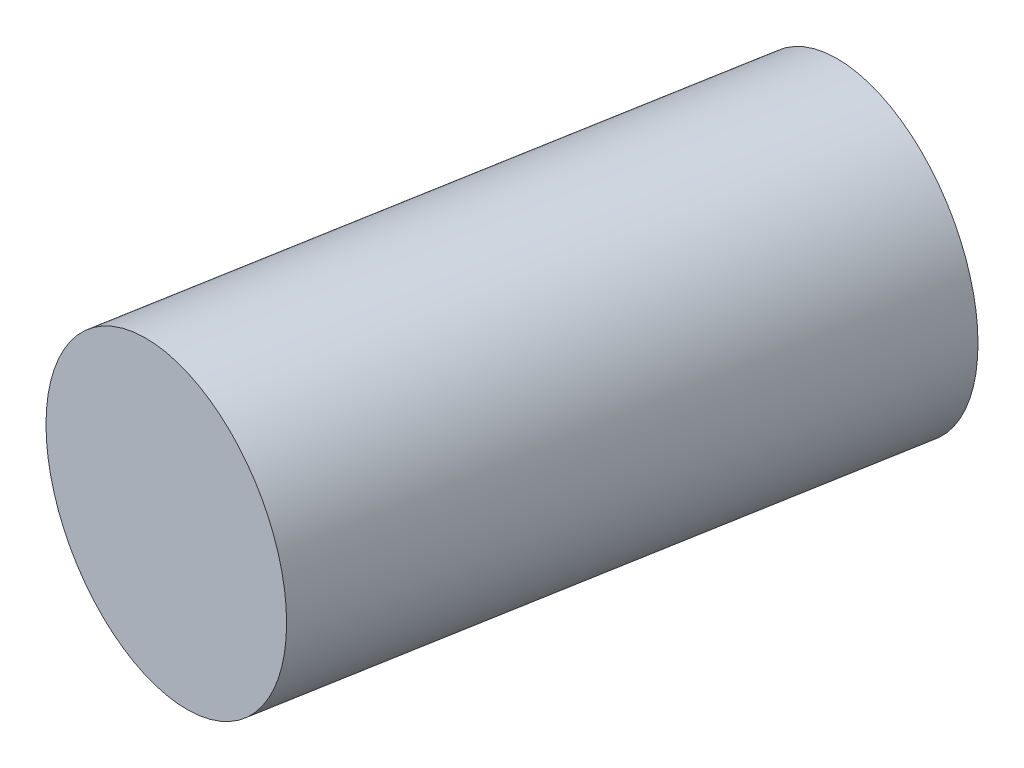
ISO-10303-21;
HEADER;
FILE_DESCRIPTION(('STEP AP214'),'2;1');
FILE_NAME('part.step','',(''),(''),'','','');
FILE_SCHEMA(('AUTOMOTIVE_DESIGN { 1 0 10303 214 1 1 1 1 }'));
ENDSEC;
DATA;
#1=APPLICATION_CONTEXT('core data for automotive mechanical design processes');
#2=APPLICATION_PROTOCOL_DEFINITION('international standard','automotive_design',2000,#1);
#3=PRODUCT_CONTEXT('',#1,'mechanical');
#4=PRODUCT('Part','Part','',(#3));
#5=PRODUCT_RELATED_PRODUCT_CATEGORY('part','',(#4));
#6=PRODUCT_DEFINITION_FORMATION('','',#4);
#7=PRODUCT_DEFINITION_CONTEXT('part definition',#1,'design');
#8=PRODUCT_DEFINITION('design','',#6,#7);
#9=PRODUCT_DEFINITION_SHAPE('','',#8);
#10=(LENGTH_UNIT() NAMED_UNIT(*) SI_UNIT(.MILLI.,.METRE.));
#11=(NAMED_UNIT(*) PLANE_ANGLE_UNIT() SI_UNIT($,.RADIAN.));
#12=(NAMED_UNIT(*) SI_UNIT($,.STERADIAN.) SOLID_ANGLE_UNIT());
#13=UNCERTAINTY_MEASURE_WITH_UNIT(LENGTH_MEASURE(1.E-05),#10,'distance_accuracy_value','');
#14=(GEOMETRIC_REPRESENTATION_CONTEXT(3) GLOBAL_UNCERTAINTY_ASSIGNED_CONTEXT((#13)) GLOBAL_UNIT_ASSIGNED_CONTEXT((#10,
#11,#12)) REPRESENTATION_CONTEXT('',''));
#15=CARTESIAN_POINT('',(0.,0.,0.));
#16=DIRECTION('',(0.,0.,1.));
#17=DIRECTION('',(1.,0.,0.));
#18=AXIS2_PLACEMENT_3D('',#15,#16,#17);
#19=CARTESIAN_POINT('',(14.3689340022176,0.,-2.83947693854923));
#20=DIRECTION('',(-0.173648177666927,0.,0.984807753012209));
#21=DIRECTION('',(-0.984807753012209,0.,-0.173648177666927));
#22=AXIS2_PLACEMENT_3D('',#19,#20,#21);
#23=PLANE('',#22);
#24=CARTESIAN_POINT('',(12.4660881637494,0.,-3.175));
#25=DIRECTION('',(-0.173648177666927,0.,0.984807753012209));
#26=DIRECTION('',(-0.984807753012209,0.,-0.173648177666927));
#27=AXIS2_PLACEMENT_3D('',#24,#25,#26);
#28=CIRCLE('',#27,1.93220030269668);
#29=CARTESIAN_POINT('',(10.5632423252812,0.,-3.51052306145076));
#30=VERTEX_POINT('',#29);
#31=EDGE_CURVE('E22',#30,#30,#28,.T.);
#32=ORIENTED_EDGE('',*,*,#31,.F.);
#33=EDGE_LOOP('',(#32));
#34=FACE_BOUND('',#33,.T.);
#35=ADVANCED_FACE('F15',(#34),#23,.F.);
#36=CARTESIAN_POINT('',(10.9265332134386,0.,5.55625000000001));
#37=DIRECTION('',(-0.173648177666927,0.,0.984807753012209));
#38=DIRECTION('',(-0.984807753012209,0.,-0.173648177666927));
#39=AXIS2_PLACEMENT_3D('',#36,#37,#38);
#40=CYLINDRICAL_SURFACE('',#39,1.93220030269667);
#41=CARTESIAN_POINT('',(11.1156843038204,0.,4.48352085995661));
#42=DIRECTION('',(-0.173648177666927,0.,0.984807753012209));
#43=DIRECTION('',(-0.984807753012209,0.,-0.173648177666927));
#44=AXIS2_PLACEMENT_3D('',#41,#42,#43);
#45=CIRCLE('',#44,1.93220030269667);
#46=CARTESIAN_POINT('',(9.21283846535218,0.,4.14799779850585));
#47=VERTEX_POINT('',#46);
#48=EDGE_CURVE('E10',#47,#47,#45,.T.);
#49=ORIENTED_EDGE('',*,*,#48,.F.);
#50=EDGE_LOOP('',(#49));
#51=FACE_BOUND('',#50,.T.);
#52=ORIENTED_EDGE('',*,*,#31,.T.);
#53=EDGE_LOOP('',(#52));
#54=FACE_BOUND('',#53,.T.);
#55=ADVANCED_FACE('F28',(#51,#54),#40,.T.);
#56=CARTESIAN_POINT('',(11.1156843038204,0.,4.48352085995661));
#57=DIRECTION('',(0.173648177666927,0.,-0.984807753012209));
#58=DIRECTION('',(0.984807753012209,0.,0.173648177666927));
#59=AXIS2_PLACEMENT_3D('',#56,#57,#58);
#60=PLANE('',#59);
#61=ORIENTED_EDGE('',*,*,#48,.T.);
#62=EDGE_LOOP('',(#61));
#63=FACE_BOUND('',#62,.T.);
#64=ADVANCED_FACE('F17',(#63),#60,.F.);
#65=CLOSED_SHELL('',(#35,#55,#64));
#66=MANIFOLD_SOLID_BREP('B1',#65);
#67=ADVANCED_BREP_SHAPE_REPRESENTATION('',(#18,#66),#14);
#68=SHAPE_DEFINITION_REPRESENTATION(#9,#67);
ENDSEC;
END-ISO-10303-21;
